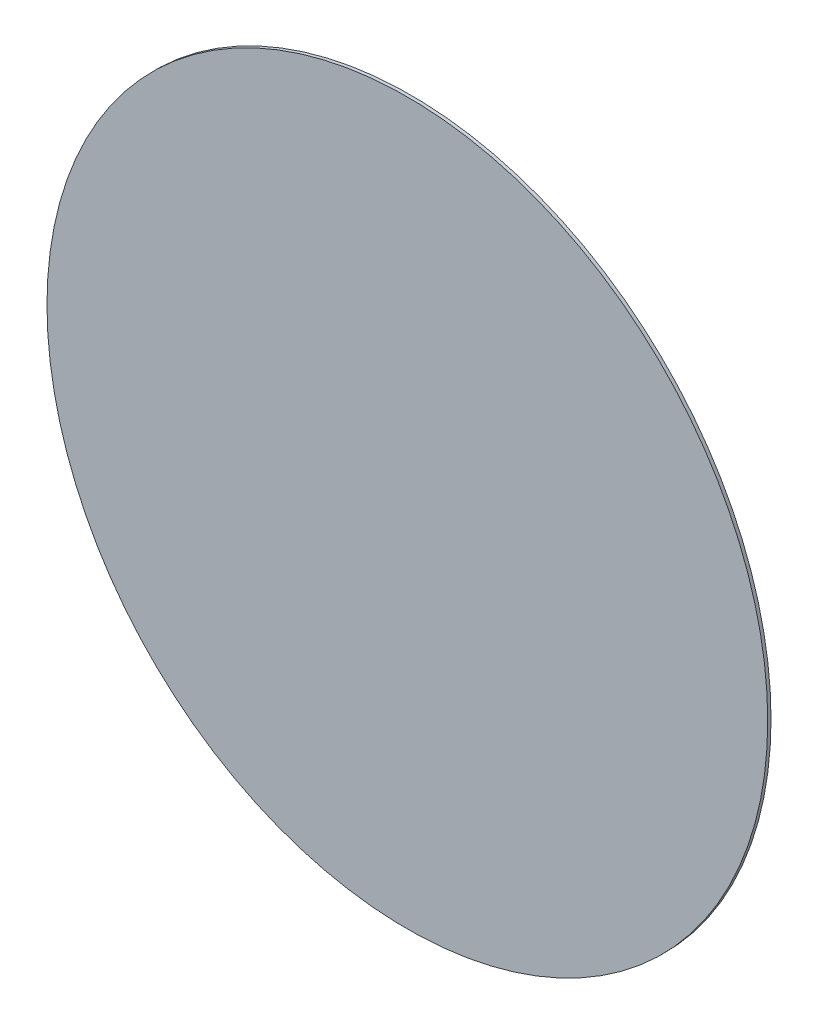
ISO-10303-21;
HEADER;
FILE_DESCRIPTION(('STEP AP214'),'2;1');
FILE_NAME('part.step','',(''),(''),'','','');
FILE_SCHEMA(('AUTOMOTIVE_DESIGN { 1 0 10303 214 1 1 1 1 }'));
ENDSEC;
DATA;
#1=APPLICATION_CONTEXT('core data for automotive mechanical design processes');
#2=APPLICATION_PROTOCOL_DEFINITION('international standard','automotive_design',2000,#1);
#3=PRODUCT_CONTEXT('',#1,'mechanical');
#4=PRODUCT('Part','Part','',(#3));
#5=PRODUCT_RELATED_PRODUCT_CATEGORY('part','',(#4));
#6=PRODUCT_DEFINITION_FORMATION('','',#4);
#7=PRODUCT_DEFINITION_CONTEXT('part definition',#1,'design');
#8=PRODUCT_DEFINITION('design','',#6,#7);
#9=PRODUCT_DEFINITION_SHAPE('','',#8);
#10=(LENGTH_UNIT() NAMED_UNIT(*) SI_UNIT(.MILLI.,.METRE.));
#11=(NAMED_UNIT(*) PLANE_ANGLE_UNIT() SI_UNIT($,.RADIAN.));
#12=(NAMED_UNIT(*) SI_UNIT($,.STERADIAN.) SOLID_ANGLE_UNIT());
#13=UNCERTAINTY_MEASURE_WITH_UNIT(LENGTH_MEASURE(1.E-05),#10,'distance_accuracy_value','');
#14=(GEOMETRIC_REPRESENTATION_CONTEXT(3) GLOBAL_UNCERTAINTY_ASSIGNED_CONTEXT((#13)) GLOBAL_UNIT_ASSIGNED_CONTEXT((#10,
#11,#12)) REPRESENTATION_CONTEXT('',''));
#15=CARTESIAN_POINT('',(0.,0.,0.));
#16=DIRECTION('',(0.,0.,1.));
#17=DIRECTION('',(1.,0.,0.));
#18=AXIS2_PLACEMENT_3D('',#15,#16,#17);
#19=CARTESIAN_POINT('',(0.,0.,0.1));
#20=DIRECTION('',(0.,0.,-1.));
#21=DIRECTION('',(-1.,0.,0.));
#22=AXIS2_PLACEMENT_3D('',#19,#20,#21);
#23=CYLINDRICAL_SURFACE('',#22,11.);
#24=CARTESIAN_POINT('',(0.,0.,0.1));
#25=DIRECTION('',(0.,0.,1.));
#26=DIRECTION('',(1.,0.,0.));
#27=AXIS2_PLACEMENT_3D('',#24,#25,#26);
#28=CIRCLE('',#27,11.);
#29=CARTESIAN_POINT('',(11.,0.,0.1));
#30=VERTEX_POINT('',#29);
#31=EDGE_CURVE('E10',#30,#30,#28,.T.);
#32=ORIENTED_EDGE('',*,*,#31,.F.);
#33=EDGE_LOOP('',(#32));
#34=FACE_BOUND('',#33,.T.);
#35=CARTESIAN_POINT('',(0.,0.,0.));
#36=DIRECTION('',(0.,0.,1.));
#37=DIRECTION('',(1.,0.,0.));
#38=AXIS2_PLACEMENT_3D('',#35,#36,#37);
#39=CIRCLE('',#38,11.);
#40=CARTESIAN_POINT('',(11.,0.,0.));
#41=VERTEX_POINT('',#40);
#42=EDGE_CURVE('E35',#41,#41,#39,.T.);
#43=ORIENTED_EDGE('',*,*,#42,.T.);
#44=EDGE_LOOP('',(#43));
#45=FACE_BOUND('',#44,.T.);
#46=ADVANCED_FACE('F32',(#34,#45),#23,.T.);
#47=CARTESIAN_POINT('',(0.,0.,0.1));
#48=DIRECTION('',(0.,0.,1.));
#49=DIRECTION('',(1.,0.,0.));
#50=AXIS2_PLACEMENT_3D('',#47,#48,#49);
#51=PLANE('',#50);
#52=ORIENTED_EDGE('',*,*,#31,.T.);
#53=EDGE_LOOP('',(#52));
#54=FACE_BOUND('',#53,.T.);
#55=ADVANCED_FACE('F47',(#54),#51,.T.);
#56=CARTESIAN_POINT('',(0.,0.,0.));
#57=DIRECTION('',(0.,0.,1.));
#58=DIRECTION('',(1.,0.,0.));
#59=AXIS2_PLACEMENT_3D('',#56,#57,#58);
#60=PLANE('',#59);
#61=ORIENTED_EDGE('',*,*,#42,.F.);
#62=EDGE_LOOP('',(#61));
#63=FACE_BOUND('',#62,.T.);
#64=ADVANCED_FACE('F45',(#63),#60,.F.);
#65=CLOSED_SHELL('',(#46,#55,#64));
#66=MANIFOLD_SOLID_BREP('B2',#65);
#67=ADVANCED_BREP_SHAPE_REPRESENTATION('',(#18,#66),#14);
#68=SHAPE_DEFINITION_REPRESENTATION(#9,#67);
ENDSEC;
END-ISO-10303-21;
